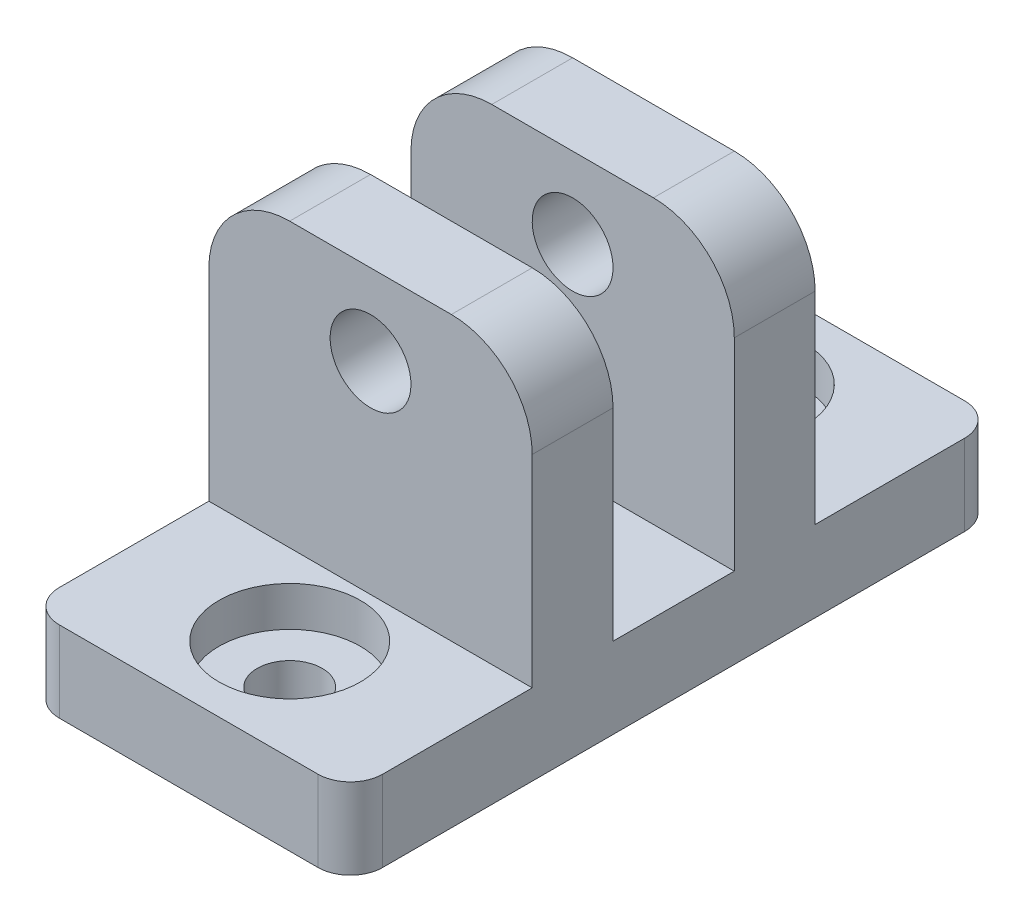
ISO-10303-21;
HEADER;
FILE_DESCRIPTION(('STEP AP214'),'2;1');
FILE_NAME('part.step','',(''),(''),'','','');
FILE_SCHEMA(('AUTOMOTIVE_DESIGN { 1 0 10303 214 1 1 1 1 }'));
ENDSEC;
DATA;
#1=APPLICATION_CONTEXT('core data for automotive mechanical design processes');
#2=APPLICATION_PROTOCOL_DEFINITION('international standard','automotive_design',2000,#1);
#3=PRODUCT_CONTEXT('',#1,'mechanical');
#4=PRODUCT('Part','Part','',(#3));
#5=PRODUCT_RELATED_PRODUCT_CATEGORY('part','',(#4));
#6=PRODUCT_DEFINITION_FORMATION('','',#4);
#7=PRODUCT_DEFINITION_CONTEXT('part definition',#1,'design');
#8=PRODUCT_DEFINITION('design','',#6,#7);
#9=PRODUCT_DEFINITION_SHAPE('','',#8);
#10=(LENGTH_UNIT() NAMED_UNIT(*) SI_UNIT(.MILLI.,.METRE.));
#11=(NAMED_UNIT(*) PLANE_ANGLE_UNIT() SI_UNIT($,.RADIAN.));
#12=(NAMED_UNIT(*) SI_UNIT($,.STERADIAN.) SOLID_ANGLE_UNIT());
#13=UNCERTAINTY_MEASURE_WITH_UNIT(LENGTH_MEASURE(1.E-05),#10,'distance_accuracy_value','');
#14=(GEOMETRIC_REPRESENTATION_CONTEXT(3) GLOBAL_UNCERTAINTY_ASSIGNED_CONTEXT((#13)) GLOBAL_UNIT_ASSIGNED_CONTEXT((#10,
#11,#12)) REPRESENTATION_CONTEXT('',''));
#15=CARTESIAN_POINT('',(0.,0.,0.));
#16=DIRECTION('',(0.,0.,1.));
#17=DIRECTION('',(1.,0.,0.));
#18=AXIS2_PLACEMENT_3D('',#15,#16,#17);
#19=CARTESIAN_POINT('',(0.,28.575,0.));
#20=DIRECTION('',(0.,-1.,0.));
#21=DIRECTION('',(0.,0.,-1.));
#22=AXIS2_PLACEMENT_3D('',#19,#20,#21);
#23=PLANE('',#22);
#24=DIRECTION('',(1.,0.,0.));
#25=VECTOR('',#24,1.);
#26=CARTESIAN_POINT('',(-12.7,28.575,11.1125));
#27=LINE('',#26,#25);
#28=CARTESIAN_POINT('',(-6.35,28.575,11.1125));
#29=VERTEX_POINT('',#28);
#30=CARTESIAN_POINT('',(6.35,28.575,11.1125));
#31=VERTEX_POINT('',#30);
#32=EDGE_CURVE('E311',#29,#31,#27,.T.);
#33=ORIENTED_EDGE('',*,*,#32,.T.);
#34=DIRECTION('',(0.,0.,-1.));
#35=VECTOR('',#34,1.);
#36=CARTESIAN_POINT('',(6.35,28.575,0.));
#37=LINE('',#36,#35);
#38=CARTESIAN_POINT('',(6.35,28.575,4.7625));
#39=VERTEX_POINT('',#38);
#40=EDGE_CURVE('E341',#31,#39,#37,.T.);
#41=ORIENTED_EDGE('',*,*,#40,.T.);
#42=DIRECTION('',(1.,0.,0.));
#43=VECTOR('',#42,1.);
#44=CARTESIAN_POINT('',(-12.7,28.575,4.7625));
#45=LINE('',#44,#43);
#46=CARTESIAN_POINT('',(-6.35,28.575,4.7625));
#47=VERTEX_POINT('',#46);
#48=EDGE_CURVE('E257',#47,#39,#45,.T.);
#49=ORIENTED_EDGE('',*,*,#48,.F.);
#50=DIRECTION('',(0.,0.,1.));
#51=VECTOR('',#50,1.);
#52=CARTESIAN_POINT('',(-6.35,28.575,0.));
#53=LINE('',#52,#51);
#54=EDGE_CURVE('E337',#47,#29,#53,.T.);
#55=ORIENTED_EDGE('',*,*,#54,.T.);
#56=EDGE_LOOP('',(#33,#41,#49,#55));
#57=FACE_BOUND('',#56,.T.);
#58=ADVANCED_FACE('F42',(#57),#23,.F.);
#59=CARTESIAN_POINT('',(12.7,28.575,25.4));
#60=DIRECTION('',(-1.,0.,0.));
#61=DIRECTION('',(0.,0.,1.));
#62=AXIS2_PLACEMENT_3D('',#59,#60,#61);
#63=PLANE('',#62);
#64=DIRECTION('',(0.,0.,-1.));
#65=VECTOR('',#64,1.);
#66=CARTESIAN_POINT('',(12.7,6.35,25.4));
#67=LINE('',#66,#65);
#68=CARTESIAN_POINT('',(12.7,6.35,22.86));
#69=VERTEX_POINT('',#68);
#70=CARTESIAN_POINT('',(12.7,6.35,11.1125));
#71=VERTEX_POINT('',#70);
#72=EDGE_CURVE('E261',#69,#71,#67,.T.);
#73=ORIENTED_EDGE('',*,*,#72,.F.);
#74=DIRECTION('',(0.,-1.,0.));
#75=VECTOR('',#74,1.);
#76=CARTESIAN_POINT('',(12.7,28.575,22.86));
#77=LINE('',#76,#75);
#78=CARTESIAN_POINT('',(12.7,0.,22.86));
#79=VERTEX_POINT('',#78);
#80=EDGE_CURVE('E391',#69,#79,#77,.T.);
#81=ORIENTED_EDGE('',*,*,#80,.T.);
#82=DIRECTION('',(0.,0.,-1.));
#83=VECTOR('',#82,1.);
#84=CARTESIAN_POINT('',(12.7,0.,25.4));
#85=LINE('',#84,#83);
#86=CARTESIAN_POINT('',(12.7,0.,-22.86));
#87=VERTEX_POINT('',#86);
#88=EDGE_CURVE('E315',#79,#87,#85,.T.);
#89=ORIENTED_EDGE('',*,*,#88,.T.);
#90=DIRECTION('',(0.,-1.,0.));
#91=VECTOR('',#90,1.);
#92=CARTESIAN_POINT('',(12.7,28.575,-22.86));
#93=LINE('',#92,#91);
#94=CARTESIAN_POINT('',(12.7,6.35,-22.86));
#95=VERTEX_POINT('',#94);
#96=EDGE_CURVE('E388',#87,#95,#93,.F.);
#97=ORIENTED_EDGE('',*,*,#96,.T.);
#98=DIRECTION('',(0.,0.,-1.));
#99=VECTOR('',#98,1.);
#100=CARTESIAN_POINT('',(12.7,6.35,-25.4));
#101=LINE('',#100,#99);
#102=CARTESIAN_POINT('',(12.7,6.35,-11.1125));
#103=VERTEX_POINT('',#102);
#104=EDGE_CURVE('E233',#103,#95,#101,.T.);
#105=ORIENTED_EDGE('',*,*,#104,.F.);
#106=DIRECTION('',(0.,-1.,0.));
#107=VECTOR('',#106,1.);
#108=CARTESIAN_POINT('',(12.7,28.575,-11.1125));
#109=LINE('',#108,#107);
#110=CARTESIAN_POINT('',(12.7,22.225,-11.1125));
#111=VERTEX_POINT('',#110);
#112=EDGE_CURVE('E240',#111,#103,#109,.T.);
#113=ORIENTED_EDGE('',*,*,#112,.F.);
#114=DIRECTION('',(0.,0.,-1.));
#115=VECTOR('',#114,1.);
#116=CARTESIAN_POINT('',(12.7,22.225,25.4));
#117=LINE('',#116,#115);
#118=CARTESIAN_POINT('',(12.7,22.225,-4.7625));
#119=VERTEX_POINT('',#118);
#120=EDGE_CURVE('E351',#111,#119,#117,.F.);
#121=ORIENTED_EDGE('',*,*,#120,.T.);
#122=DIRECTION('',(0.,1.,0.));
#123=VECTOR('',#122,1.);
#124=CARTESIAN_POINT('',(12.7,28.575,-4.7625));
#125=LINE('',#124,#123);
#126=CARTESIAN_POINT('',(12.7,6.35,-4.7625));
#127=VERTEX_POINT('',#126);
#128=EDGE_CURVE('E267',#127,#119,#125,.T.);
#129=ORIENTED_EDGE('',*,*,#128,.F.);
#130=DIRECTION('',(0.,0.,-1.));
#131=VECTOR('',#130,1.);
#132=CARTESIAN_POINT('',(12.7,6.35,4.76249999999999));
#133=LINE('',#132,#131);
#134=CARTESIAN_POINT('',(12.7,6.35,4.76249999999999));
#135=VERTEX_POINT('',#134);
#136=EDGE_CURVE('E277',#135,#127,#133,.T.);
#137=ORIENTED_EDGE('',*,*,#136,.F.);
#138=DIRECTION('',(0.,-1.,0.));
#139=VECTOR('',#138,1.);
#140=CARTESIAN_POINT('',(12.7,28.575,4.7625));
#141=LINE('',#140,#139);
#142=CARTESIAN_POINT('',(12.7,22.225,4.7625));
#143=VERTEX_POINT('',#142);
#144=EDGE_CURVE('E274',#143,#135,#141,.T.);
#145=ORIENTED_EDGE('',*,*,#144,.F.);
#146=DIRECTION('',(0.,0.,-1.));
#147=VECTOR('',#146,1.);
#148=CARTESIAN_POINT('',(12.7,22.225,25.4));
#149=LINE('',#148,#147);
#150=CARTESIAN_POINT('',(12.7,22.225,11.1125));
#151=VERTEX_POINT('',#150);
#152=EDGE_CURVE('E354',#143,#151,#149,.F.);
#153=ORIENTED_EDGE('',*,*,#152,.T.);
#154=DIRECTION('',(0.,1.,0.));
#155=VECTOR('',#154,1.);
#156=CARTESIAN_POINT('',(12.7,28.575,11.1125));
#157=LINE('',#156,#155);
#158=EDGE_CURVE('E301',#71,#151,#157,.T.);
#159=ORIENTED_EDGE('',*,*,#158,.F.);
#160=EDGE_LOOP('',(#73,#81,#89,#97,#105,#113,#121,#129,#137,#145,#153,#159));
#161=FACE_BOUND('',#160,.T.);
#162=ADVANCED_FACE('F456',(#161),#63,.F.);
#163=CARTESIAN_POINT('',(-12.7,28.575,-25.4));
#164=DIRECTION('',(0.,0.,1.));
#165=DIRECTION('',(1.,0.,0.));
#166=AXIS2_PLACEMENT_3D('',#163,#164,#165);
#167=PLANE('',#166);
#168=DIRECTION('',(1.,0.,0.));
#169=VECTOR('',#168,1.);
#170=CARTESIAN_POINT('',(-12.7,6.35,-25.4));
#171=LINE('',#170,#169);
#172=CARTESIAN_POINT('',(-10.16,6.35,-25.4));
#173=VERTEX_POINT('',#172);
#174=CARTESIAN_POINT('',(10.16,6.35,-25.4));
#175=VERTEX_POINT('',#174);
#176=EDGE_CURVE('E243',#173,#175,#171,.T.);
#177=ORIENTED_EDGE('',*,*,#176,.T.);
#178=DIRECTION('',(0.,-1.,0.));
#179=VECTOR('',#178,1.);
#180=CARTESIAN_POINT('',(10.16,28.575,-25.4));
#181=LINE('',#180,#179);
#182=CARTESIAN_POINT('',(10.16,0.,-25.4));
#183=VERTEX_POINT('',#182);
#184=EDGE_CURVE('E423',#175,#183,#181,.T.);
#185=ORIENTED_EDGE('',*,*,#184,.T.);
#186=DIRECTION('',(-1.,0.,0.));
#187=VECTOR('',#186,1.);
#188=CARTESIAN_POINT('',(-12.7,0.,-25.4));
#189=LINE('',#188,#187);
#190=CARTESIAN_POINT('',(-10.16,0.,-25.4));
#191=VERTEX_POINT('',#190);
#192=EDGE_CURVE('E326',#183,#191,#189,.T.);
#193=ORIENTED_EDGE('',*,*,#192,.T.);
#194=DIRECTION('',(0.,-1.,0.));
#195=VECTOR('',#194,1.);
#196=CARTESIAN_POINT('',(-10.16,28.575,-25.4));
#197=LINE('',#196,#195);
#198=EDGE_CURVE('E420',#191,#173,#197,.F.);
#199=ORIENTED_EDGE('',*,*,#198,.T.);
#200=EDGE_LOOP('',(#177,#185,#193,#199));
#201=FACE_BOUND('',#200,.T.);
#202=ADVANCED_FACE('F463',(#201),#167,.F.);
#203=CARTESIAN_POINT('',(-12.7,28.575,25.4));
#204=DIRECTION('',(1.,0.,0.));
#205=DIRECTION('',(0.,0.,-1.));
#206=AXIS2_PLACEMENT_3D('',#203,#204,#205);
#207=PLANE('',#206);
#208=DIRECTION('',(0.,0.,1.));
#209=VECTOR('',#208,1.);
#210=CARTESIAN_POINT('',(-12.7,0.,25.4));
#211=LINE('',#210,#209);
#212=CARTESIAN_POINT('',(-12.7,0.,-22.86));
#213=VERTEX_POINT('',#212);
#214=CARTESIAN_POINT('',(-12.7,0.,22.86));
#215=VERTEX_POINT('',#214);
#216=EDGE_CURVE('E330',#213,#215,#211,.T.);
#217=ORIENTED_EDGE('',*,*,#216,.T.);
#218=DIRECTION('',(0.,-1.,0.));
#219=VECTOR('',#218,1.);
#220=CARTESIAN_POINT('',(-12.7,28.575,22.86));
#221=LINE('',#220,#219);
#222=CARTESIAN_POINT('',(-12.7,6.35,22.86));
#223=VERTEX_POINT('',#222);
#224=EDGE_CURVE('E11',#215,#223,#221,.F.);
#225=ORIENTED_EDGE('',*,*,#224,.T.);
#226=DIRECTION('',(0.,0.,-1.));
#227=VECTOR('',#226,1.);
#228=CARTESIAN_POINT('',(-12.7,6.35,25.4));
#229=LINE('',#228,#227);
#230=CARTESIAN_POINT('',(-12.7,6.35,11.1125));
#231=VERTEX_POINT('',#230);
#232=EDGE_CURVE('E297',#223,#231,#229,.T.);
#233=ORIENTED_EDGE('',*,*,#232,.T.);
#234=DIRECTION('',(0.,1.,0.));
#235=VECTOR('',#234,1.);
#236=CARTESIAN_POINT('',(-12.7,28.575,11.1125));
#237=LINE('',#236,#235);
#238=CARTESIAN_POINT('',(-12.7,22.225,11.1125));
#239=VERTEX_POINT('',#238);
#240=EDGE_CURVE('E300',#231,#239,#237,.T.);
#241=ORIENTED_EDGE('',*,*,#240,.T.);
#242=DIRECTION('',(0.,0.,1.));
#243=VECTOR('',#242,1.);
#244=CARTESIAN_POINT('',(-12.7,22.225,25.4));
#245=LINE('',#244,#243);
#246=CARTESIAN_POINT('',(-12.7,22.225,4.7625));
#247=VERTEX_POINT('',#246);
#248=EDGE_CURVE('E383',#239,#247,#245,.F.);
#249=ORIENTED_EDGE('',*,*,#248,.T.);
#250=DIRECTION('',(0.,-1.,0.));
#251=VECTOR('',#250,1.);
#252=CARTESIAN_POINT('',(-12.7,28.575,4.7625));
#253=LINE('',#252,#251);
#254=CARTESIAN_POINT('',(-12.7,6.35,4.76249999999999));
#255=VERTEX_POINT('',#254);
#256=EDGE_CURVE('E263',#247,#255,#253,.T.);
#257=ORIENTED_EDGE('',*,*,#256,.T.);
#258=DIRECTION('',(0.,0.,-1.));
#259=VECTOR('',#258,1.);
#260=CARTESIAN_POINT('',(-12.7,6.35,4.76249999999999));
#261=LINE('',#260,#259);
#262=CARTESIAN_POINT('',(-12.7,6.35,-4.7625));
#263=VERTEX_POINT('',#262);
#264=EDGE_CURVE('E266',#255,#263,#261,.T.);
#265=ORIENTED_EDGE('',*,*,#264,.T.);
#266=DIRECTION('',(0.,1.,0.));
#267=VECTOR('',#266,1.);
#268=CARTESIAN_POINT('',(-12.7,28.575,-4.7625));
#269=LINE('',#268,#267);
#270=CARTESIAN_POINT('',(-12.7,22.225,-4.7625));
#271=VERTEX_POINT('',#270);
#272=EDGE_CURVE('E270',#263,#271,#269,.T.);
#273=ORIENTED_EDGE('',*,*,#272,.T.);
#274=DIRECTION('',(0.,0.,1.));
#275=VECTOR('',#274,1.);
#276=CARTESIAN_POINT('',(-12.7,22.225,25.4));
#277=LINE('',#276,#275);
#278=CARTESIAN_POINT('',(-12.7,22.225,-11.1125));
#279=VERTEX_POINT('',#278);
#280=EDGE_CURVE('E229',#271,#279,#277,.F.);
#281=ORIENTED_EDGE('',*,*,#280,.T.);
#282=DIRECTION('',(0.,-1.,0.));
#283=VECTOR('',#282,1.);
#284=CARTESIAN_POINT('',(-12.7,28.575,-11.1125));
#285=LINE('',#284,#283);
#286=CARTESIAN_POINT('',(-12.7,6.35,-11.1125));
#287=VERTEX_POINT('',#286);
#288=EDGE_CURVE('E220',#279,#287,#285,.T.);
#289=ORIENTED_EDGE('',*,*,#288,.T.);
#290=DIRECTION('',(0.,0.,-1.));
#291=VECTOR('',#290,1.);
#292=CARTESIAN_POINT('',(-12.7,6.35,-25.4));
#293=LINE('',#292,#291);
#294=CARTESIAN_POINT('',(-12.7,6.35,-22.86));
#295=VERTEX_POINT('',#294);
#296=EDGE_CURVE('E225',#287,#295,#293,.T.);
#297=ORIENTED_EDGE('',*,*,#296,.T.);
#298=DIRECTION('',(0.,-1.,0.));
#299=VECTOR('',#298,1.);
#300=CARTESIAN_POINT('',(-12.7,28.575,-22.86));
#301=LINE('',#300,#299);
#302=EDGE_CURVE('E51',#295,#213,#301,.T.);
#303=ORIENTED_EDGE('',*,*,#302,.T.);
#304=EDGE_LOOP('',(#217,#225,#233,#241,#249,#257,#265,#273,#281,#289,#297,#303));
#305=FACE_BOUND('',#304,.T.);
#306=ADVANCED_FACE('F223',(#305),#207,.F.);
#307=CARTESIAN_POINT('',(-12.7,28.575,25.4));
#308=DIRECTION('',(0.,0.,-1.));
#309=DIRECTION('',(-1.,0.,0.));
#310=AXIS2_PLACEMENT_3D('',#307,#308,#309);
#311=PLANE('',#310);
#312=DIRECTION('',(1.,0.,0.));
#313=VECTOR('',#312,1.);
#314=CARTESIAN_POINT('',(-12.7,0.,25.4));
#315=LINE('',#314,#313);
#316=CARTESIAN_POINT('',(-10.16,0.,25.4));
#317=VERTEX_POINT('',#316);
#318=CARTESIAN_POINT('',(10.16,0.,25.4));
#319=VERTEX_POINT('',#318);
#320=EDGE_CURVE('E333',#317,#319,#315,.T.);
#321=ORIENTED_EDGE('',*,*,#320,.T.);
#322=DIRECTION('',(0.,-1.,0.));
#323=VECTOR('',#322,1.);
#324=CARTESIAN_POINT('',(10.16,28.575,25.4));
#325=LINE('',#324,#323);
#326=CARTESIAN_POINT('',(10.16,6.35,25.4));
#327=VERTEX_POINT('',#326);
#328=EDGE_CURVE('E411',#319,#327,#325,.F.);
#329=ORIENTED_EDGE('',*,*,#328,.T.);
#330=DIRECTION('',(1.,0.,0.));
#331=VECTOR('',#330,1.);
#332=CARTESIAN_POINT('',(-12.7,6.35,25.4));
#333=LINE('',#332,#331);
#334=CARTESIAN_POINT('',(-10.16,6.35,25.4));
#335=VERTEX_POINT('',#334);
#336=EDGE_CURVE('E305',#335,#327,#333,.T.);
#337=ORIENTED_EDGE('',*,*,#336,.F.);
#338=DIRECTION('',(0.,-1.,0.));
#339=VECTOR('',#338,1.);
#340=CARTESIAN_POINT('',(-10.16,28.575,25.4));
#341=LINE('',#340,#339);
#342=EDGE_CURVE('E407',#335,#317,#341,.T.);
#343=ORIENTED_EDGE('',*,*,#342,.T.);
#344=EDGE_LOOP('',(#321,#329,#337,#343));
#345=FACE_BOUND('',#344,.T.);
#346=ADVANCED_FACE('F445',(#345),#311,.F.);
#347=DIRECTION('',(1.,0.,0.));
#348=VECTOR('',#347,1.);
#349=CARTESIAN_POINT('',(-12.7,28.575,-4.7625));
#350=LINE('',#349,#348);
#351=CARTESIAN_POINT('',(-6.35,28.575,-4.7625));
#352=VERTEX_POINT('',#351);
#353=CARTESIAN_POINT('',(6.35,28.575,-4.7625));
#354=VERTEX_POINT('',#353);
#355=EDGE_CURVE('E288',#352,#354,#350,.T.);
#356=ORIENTED_EDGE('',*,*,#355,.T.);
#357=DIRECTION('',(0.,0.,-1.));
#358=VECTOR('',#357,1.);
#359=CARTESIAN_POINT('',(6.35,28.575,0.));
#360=LINE('',#359,#358);
#361=CARTESIAN_POINT('',(6.35,28.575,-11.1125));
#362=VERTEX_POINT('',#361);
#363=EDGE_CURVE('E367',#354,#362,#360,.T.);
#364=ORIENTED_EDGE('',*,*,#363,.T.);
#365=DIRECTION('',(1.,0.,0.));
#366=VECTOR('',#365,1.);
#367=CARTESIAN_POINT('',(-12.7,28.575,-11.1125));
#368=LINE('',#367,#366);
#369=CARTESIAN_POINT('',(-6.35,28.575,-11.1125));
#370=VERTEX_POINT('',#369);
#371=EDGE_CURVE('E244',#370,#362,#368,.T.);
#372=ORIENTED_EDGE('',*,*,#371,.F.);
#373=DIRECTION('',(0.,0.,1.));
#374=VECTOR('',#373,1.);
#375=CARTESIAN_POINT('',(-6.35,28.575,0.));
#376=LINE('',#375,#374);
#377=EDGE_CURVE('E363',#370,#352,#376,.T.);
#378=ORIENTED_EDGE('',*,*,#377,.T.);
#379=EDGE_LOOP('',(#356,#364,#372,#378));
#380=FACE_BOUND('',#379,.T.);
#381=ADVANCED_FACE('F472',(#380),#23,.F.);
#382=CARTESIAN_POINT('',(0.,0.,0.));
#383=DIRECTION('',(0.,-1.,0.));
#384=DIRECTION('',(0.,0.,-1.));
#385=AXIS2_PLACEMENT_3D('',#382,#383,#384);
#386=PLANE('',#385);
#387=CARTESIAN_POINT('',(0.,0.,17.4625));
#388=DIRECTION('',(0.,1.,0.));
#389=DIRECTION('',(0.,0.,1.));
#390=AXIS2_PLACEMENT_3D('',#387,#388,#389);
#391=CIRCLE('',#390,2.5527);
#392=CARTESIAN_POINT('',(0.,0.,20.0152));
#393=VERTEX_POINT('',#392);
#394=EDGE_CURVE('E794',#393,#393,#391,.T.);
#395=ORIENTED_EDGE('',*,*,#394,.T.);
#396=EDGE_LOOP('',(#395));
#397=FACE_BOUND('',#396,.T.);
#398=CARTESIAN_POINT('',(0.,0.,-17.4625));
#399=DIRECTION('',(0.,1.,0.));
#400=DIRECTION('',(0.,0.,1.));
#401=AXIS2_PLACEMENT_3D('',#398,#399,#400);
#402=CIRCLE('',#401,2.5527);
#403=CARTESIAN_POINT('',(0.,0.,-14.9098));
#404=VERTEX_POINT('',#403);
#405=EDGE_CURVE('E278',#404,#404,#402,.T.);
#406=ORIENTED_EDGE('',*,*,#405,.T.);
#407=EDGE_LOOP('',(#406));
#408=FACE_BOUND('',#407,.T.);
#409=ORIENTED_EDGE('',*,*,#88,.F.);
#410=CARTESIAN_POINT('',(10.16,0.,22.86));
#411=DIRECTION('',(0.,-1.,0.));
#412=DIRECTION('',(0.,0.,-1.));
#413=AXIS2_PLACEMENT_3D('',#410,#411,#412);
#414=CIRCLE('',#413,2.54);
#415=EDGE_CURVE('E404',#79,#319,#414,.T.);
#416=ORIENTED_EDGE('',*,*,#415,.T.);
#417=ORIENTED_EDGE('',*,*,#320,.F.);
#418=CARTESIAN_POINT('',(-10.16,0.,22.86));
#419=DIRECTION('',(0.,-1.,0.));
#420=DIRECTION('',(0.,0.,-1.));
#421=AXIS2_PLACEMENT_3D('',#418,#419,#420);
#422=CIRCLE('',#421,2.54);
#423=EDGE_CURVE('E398',#317,#215,#422,.T.);
#424=ORIENTED_EDGE('',*,*,#423,.T.);
#425=ORIENTED_EDGE('',*,*,#216,.F.);
#426=CARTESIAN_POINT('',(-10.16,0.,-22.86));
#427=DIRECTION('',(0.,-1.,0.));
#428=DIRECTION('',(0.,0.,-1.));
#429=AXIS2_PLACEMENT_3D('',#426,#427,#428);
#430=CIRCLE('',#429,2.54);
#431=EDGE_CURVE('E395',#213,#191,#430,.T.);
#432=ORIENTED_EDGE('',*,*,#431,.T.);
#433=ORIENTED_EDGE('',*,*,#192,.F.);
#434=CARTESIAN_POINT('',(10.16,0.,-22.86));
#435=DIRECTION('',(0.,-1.,0.));
#436=DIRECTION('',(0.,0.,-1.));
#437=AXIS2_PLACEMENT_3D('',#434,#435,#436);
#438=CIRCLE('',#437,2.54);
#439=EDGE_CURVE('E401',#183,#87,#438,.T.);
#440=ORIENTED_EDGE('',*,*,#439,.T.);
#441=EDGE_LOOP('',(#409,#416,#417,#424,#425,#432,#433,#440));
#442=FACE_BOUND('',#441,.T.);
#443=ADVANCED_FACE('F436',(#397,#408,#442),#386,.T.);
#444=CARTESIAN_POINT('',(-12.7,28.575,11.1125));
#445=DIRECTION('',(0.,0.,-1.));
#446=DIRECTION('',(0.,1.,0.));
#447=AXIS2_PLACEMENT_3D('',#444,#445,#446);
#448=PLANE('',#447);
#449=CARTESIAN_POINT('',(0.,22.225,11.1125));
#450=DIRECTION('',(0.,0.,-1.));
#451=DIRECTION('',(0.,1.,0.));
#452=AXIS2_PLACEMENT_3D('',#449,#450,#451);
#453=CIRCLE('',#452,3.175);
#454=CARTESIAN_POINT('',(0.,25.4,11.1125));
#455=VERTEX_POINT('',#454);
#456=EDGE_CURVE('E771',#455,#455,#453,.T.);
#457=ORIENTED_EDGE('',*,*,#456,.T.);
#458=EDGE_LOOP('',(#457));
#459=FACE_BOUND('',#458,.T.);
#460=ORIENTED_EDGE('',*,*,#158,.T.);
#461=CARTESIAN_POINT('',(6.35,22.225,11.1125));
#462=DIRECTION('',(0.,0.,-1.));
#463=DIRECTION('',(0.,1.,0.));
#464=AXIS2_PLACEMENT_3D('',#461,#462,#463);
#465=CIRCLE('',#464,6.35);
#466=EDGE_CURVE('E360',#151,#31,#465,.F.);
#467=ORIENTED_EDGE('',*,*,#466,.T.);
#468=ORIENTED_EDGE('',*,*,#32,.F.);
#469=CARTESIAN_POINT('',(-6.35,22.225,11.1125));
#470=DIRECTION('',(0.,0.,-1.));
#471=DIRECTION('',(0.,1.,0.));
#472=AXIS2_PLACEMENT_3D('',#469,#470,#471);
#473=CIRCLE('',#472,6.35);
#474=EDGE_CURVE('E357',#29,#239,#473,.F.);
#475=ORIENTED_EDGE('',*,*,#474,.T.);
#476=ORIENTED_EDGE('',*,*,#240,.F.);
#477=DIRECTION('',(1.,0.,0.));
#478=VECTOR('',#477,1.);
#479=CARTESIAN_POINT('',(-12.7,6.35,11.1125));
#480=LINE('',#479,#478);
#481=EDGE_CURVE('E316',#231,#71,#480,.T.);
#482=ORIENTED_EDGE('',*,*,#481,.T.);
#483=EDGE_LOOP('',(#460,#467,#468,#475,#476,#482));
#484=FACE_BOUND('',#483,.T.);
#485=ADVANCED_FACE('F485',(#459,#484),#448,.F.);
#486=CARTESIAN_POINT('',(-12.7,6.35,25.4));
#487=DIRECTION('',(0.,-1.,0.));
#488=DIRECTION('',(0.,0.,-1.));
#489=AXIS2_PLACEMENT_3D('',#486,#487,#488);
#490=PLANE('',#489);
#491=CARTESIAN_POINT('',(0.,6.34999999999999,17.4625));
#492=DIRECTION('',(0.,1.,0.));
#493=DIRECTION('',(0.,0.,1.));
#494=AXIS2_PLACEMENT_3D('',#491,#492,#493);
#495=CIRCLE('',#494,5.55625);
#496=CARTESIAN_POINT('',(0.,6.34999999999999,23.01875));
#497=VERTEX_POINT('',#496);
#498=EDGE_CURVE('E774',#497,#497,#495,.T.);
#499=ORIENTED_EDGE('',*,*,#498,.F.);
#500=EDGE_LOOP('',(#499));
#501=FACE_BOUND('',#500,.T.);
#502=ORIENTED_EDGE('',*,*,#336,.T.);
#503=CARTESIAN_POINT('',(10.16,6.35,22.86));
#504=DIRECTION('',(0.,-1.,0.));
#505=DIRECTION('',(0.,0.,-1.));
#506=AXIS2_PLACEMENT_3D('',#503,#504,#505);
#507=CIRCLE('',#506,2.54);
#508=EDGE_CURVE('E417',#327,#69,#507,.F.);
#509=ORIENTED_EDGE('',*,*,#508,.T.);
#510=ORIENTED_EDGE('',*,*,#72,.T.);
#511=ORIENTED_EDGE('',*,*,#481,.F.);
#512=ORIENTED_EDGE('',*,*,#232,.F.);
#513=CARTESIAN_POINT('',(-10.16,6.35,22.86));
#514=DIRECTION('',(0.,-1.,0.));
#515=DIRECTION('',(0.,0.,-1.));
#516=AXIS2_PLACEMENT_3D('',#513,#514,#515);
#517=CIRCLE('',#516,2.54);
#518=EDGE_CURVE('E414',#223,#335,#517,.F.);
#519=ORIENTED_EDGE('',*,*,#518,.T.);
#520=EDGE_LOOP('',(#502,#509,#510,#511,#512,#519));
#521=FACE_BOUND('',#520,.T.);
#522=ADVANCED_FACE('F449',(#501,#521),#490,.F.);
#523=CARTESIAN_POINT('',(-12.7,28.575,4.7625));
#524=DIRECTION('',(0.,0.,1.));
#525=DIRECTION('',(0.,-1.,0.));
#526=AXIS2_PLACEMENT_3D('',#523,#524,#525);
#527=PLANE('',#526);
#528=CARTESIAN_POINT('',(0.,22.225,4.7625));
#529=DIRECTION('',(0.,0.,1.));
#530=DIRECTION('',(0.,-1.,0.));
#531=AXIS2_PLACEMENT_3D('',#528,#529,#530);
#532=CIRCLE('',#531,3.175);
#533=CARTESIAN_POINT('',(0.,19.05,4.7625));
#534=VERTEX_POINT('',#533);
#535=EDGE_CURVE('E775',#534,#534,#532,.T.);
#536=ORIENTED_EDGE('',*,*,#535,.T.);
#537=EDGE_LOOP('',(#536));
#538=FACE_BOUND('',#537,.T.);
#539=ORIENTED_EDGE('',*,*,#48,.T.);
#540=CARTESIAN_POINT('',(6.35,22.225,4.7625));
#541=DIRECTION('',(0.,0.,1.));
#542=DIRECTION('',(0.,-1.,0.));
#543=AXIS2_PLACEMENT_3D('',#540,#541,#542);
#544=CIRCLE('',#543,6.35);
#545=EDGE_CURVE('E348',#39,#143,#544,.F.);
#546=ORIENTED_EDGE('',*,*,#545,.T.);
#547=ORIENTED_EDGE('',*,*,#144,.T.);
#548=DIRECTION('',(1.,0.,0.));
#549=VECTOR('',#548,1.);
#550=CARTESIAN_POINT('',(-12.7,6.35,4.76249999999999));
#551=LINE('',#550,#549);
#552=EDGE_CURVE('E273',#255,#135,#551,.T.);
#553=ORIENTED_EDGE('',*,*,#552,.F.);
#554=ORIENTED_EDGE('',*,*,#256,.F.);
#555=CARTESIAN_POINT('',(-6.35,22.225,4.7625));
#556=DIRECTION('',(0.,0.,1.));
#557=DIRECTION('',(0.,-1.,0.));
#558=AXIS2_PLACEMENT_3D('',#555,#556,#557);
#559=CIRCLE('',#558,6.35);
#560=EDGE_CURVE('E345',#247,#47,#559,.F.);
#561=ORIENTED_EDGE('',*,*,#560,.T.);
#562=EDGE_LOOP('',(#539,#546,#547,#553,#554,#561));
#563=FACE_BOUND('',#562,.T.);
#564=ADVANCED_FACE('F523',(#538,#563),#527,.F.);
#565=CARTESIAN_POINT('',(-12.7,28.575,-4.7625));
#566=DIRECTION('',(0.,0.,-1.));
#567=DIRECTION('',(0.,1.,0.));
#568=AXIS2_PLACEMENT_3D('',#565,#566,#567);
#569=PLANE('',#568);
#570=CARTESIAN_POINT('',(0.,22.225,-4.7625));
#571=DIRECTION('',(0.,0.,-1.));
#572=DIRECTION('',(0.,1.,0.));
#573=AXIS2_PLACEMENT_3D('',#570,#571,#572);
#574=CIRCLE('',#573,3.175);
#575=CARTESIAN_POINT('',(0.,25.4,-4.7625));
#576=VERTEX_POINT('',#575);
#577=EDGE_CURVE('E783',#576,#576,#574,.T.);
#578=ORIENTED_EDGE('',*,*,#577,.T.);
#579=EDGE_LOOP('',(#578));
#580=FACE_BOUND('',#579,.T.);
#581=ORIENTED_EDGE('',*,*,#128,.T.);
#582=CARTESIAN_POINT('',(6.35,22.225,-4.7625));
#583=DIRECTION('',(0.,0.,-1.));
#584=DIRECTION('',(0.,1.,0.));
#585=AXIS2_PLACEMENT_3D('',#582,#583,#584);
#586=CIRCLE('',#585,6.35);
#587=EDGE_CURVE('E380',#119,#354,#586,.F.);
#588=ORIENTED_EDGE('',*,*,#587,.T.);
#589=ORIENTED_EDGE('',*,*,#355,.F.);
#590=CARTESIAN_POINT('',(-6.35,22.225,-4.7625));
#591=DIRECTION('',(0.,0.,-1.));
#592=DIRECTION('',(0.,1.,0.));
#593=AXIS2_PLACEMENT_3D('',#590,#591,#592);
#594=CIRCLE('',#593,6.35);
#595=EDGE_CURVE('E377',#352,#271,#594,.F.);
#596=ORIENTED_EDGE('',*,*,#595,.T.);
#597=ORIENTED_EDGE('',*,*,#272,.F.);
#598=DIRECTION('',(1.,0.,0.));
#599=VECTOR('',#598,1.);
#600=CARTESIAN_POINT('',(-12.7,6.35,-4.7625));
#601=LINE('',#600,#599);
#602=EDGE_CURVE('E292',#263,#127,#601,.T.);
#603=ORIENTED_EDGE('',*,*,#602,.T.);
#604=EDGE_LOOP('',(#581,#588,#589,#596,#597,#603));
#605=FACE_BOUND('',#604,.T.);
#606=ADVANCED_FACE('F499',(#580,#605),#569,.F.);
#607=CARTESIAN_POINT('',(-12.7,6.35,4.76249999999999));
#608=DIRECTION('',(0.,-1.,0.));
#609=DIRECTION('',(0.,0.,-1.));
#610=AXIS2_PLACEMENT_3D('',#607,#608,#609);
#611=PLANE('',#610);
#612=ORIENTED_EDGE('',*,*,#136,.T.);
#613=ORIENTED_EDGE('',*,*,#602,.F.);
#614=ORIENTED_EDGE('',*,*,#264,.F.);
#615=ORIENTED_EDGE('',*,*,#552,.T.);
#616=EDGE_LOOP('',(#612,#613,#614,#615));
#617=FACE_BOUND('',#616,.T.);
#618=ADVANCED_FACE('F503',(#617),#611,.F.);
#619=CARTESIAN_POINT('',(-12.7,6.35,-25.4));
#620=DIRECTION('',(0.,-1.,0.));
#621=DIRECTION('',(0.,0.,-1.));
#622=AXIS2_PLACEMENT_3D('',#619,#620,#621);
#623=PLANE('',#622);
#624=CARTESIAN_POINT('',(0.,6.35,-17.4625));
#625=DIRECTION('',(0.,1.,0.));
#626=DIRECTION('',(0.,0.,1.));
#627=AXIS2_PLACEMENT_3D('',#624,#625,#626);
#628=CIRCLE('',#627,5.55625);
#629=CARTESIAN_POINT('',(0.,6.35,-11.90625));
#630=VERTEX_POINT('',#629);
#631=EDGE_CURVE('E798',#630,#630,#628,.T.);
#632=ORIENTED_EDGE('',*,*,#631,.F.);
#633=EDGE_LOOP('',(#632));
#634=FACE_BOUND('',#633,.T.);
#635=ORIENTED_EDGE('',*,*,#104,.T.);
#636=CARTESIAN_POINT('',(10.16,6.35,-22.86));
#637=DIRECTION('',(0.,-1.,0.));
#638=DIRECTION('',(0.,0.,-1.));
#639=AXIS2_PLACEMENT_3D('',#636,#637,#638);
#640=CIRCLE('',#639,2.54);
#641=EDGE_CURVE('E70',#95,#175,#640,.F.);
#642=ORIENTED_EDGE('',*,*,#641,.T.);
#643=ORIENTED_EDGE('',*,*,#176,.F.);
#644=CARTESIAN_POINT('',(-10.16,6.35,-22.86));
#645=DIRECTION('',(0.,-1.,0.));
#646=DIRECTION('',(0.,0.,-1.));
#647=AXIS2_PLACEMENT_3D('',#644,#645,#646);
#648=CIRCLE('',#647,2.54);
#649=EDGE_CURVE('E61',#173,#295,#648,.F.);
#650=ORIENTED_EDGE('',*,*,#649,.T.);
#651=ORIENTED_EDGE('',*,*,#296,.F.);
#652=DIRECTION('',(1.,0.,0.));
#653=VECTOR('',#652,1.);
#654=CARTESIAN_POINT('',(-12.7,6.35,-11.1125));
#655=LINE('',#654,#653);
#656=EDGE_CURVE('E236',#287,#103,#655,.T.);
#657=ORIENTED_EDGE('',*,*,#656,.T.);
#658=EDGE_LOOP('',(#635,#642,#643,#650,#651,#657));
#659=FACE_BOUND('',#658,.T.);
#660=ADVANCED_FACE('F246',(#634,#659),#623,.F.);
#661=CARTESIAN_POINT('',(-12.7,28.575,-11.1125));
#662=DIRECTION('',(0.,0.,1.));
#663=DIRECTION('',(0.,-1.,0.));
#664=AXIS2_PLACEMENT_3D('',#661,#662,#663);
#665=PLANE('',#664);
#666=CARTESIAN_POINT('',(0.,22.225,-11.1125));
#667=DIRECTION('',(0.,0.,-1.));
#668=DIRECTION('',(0.,1.,0.));
#669=AXIS2_PLACEMENT_3D('',#666,#667,#668);
#670=CIRCLE('',#669,3.175);
#671=CARTESIAN_POINT('',(0.,25.4,-11.1125));
#672=VERTEX_POINT('',#671);
#673=EDGE_CURVE('E829',#672,#672,#670,.T.);
#674=ORIENTED_EDGE('',*,*,#673,.F.);
#675=EDGE_LOOP('',(#674));
#676=FACE_BOUND('',#675,.T.);
#677=ORIENTED_EDGE('',*,*,#371,.T.);
#678=CARTESIAN_POINT('',(6.35,22.225,-11.1125));
#679=DIRECTION('',(0.,0.,1.));
#680=DIRECTION('',(0.,-1.,0.));
#681=AXIS2_PLACEMENT_3D('',#678,#679,#680);
#682=CIRCLE('',#681,6.35);
#683=EDGE_CURVE('E374',#362,#111,#682,.F.);
#684=ORIENTED_EDGE('',*,*,#683,.T.);
#685=ORIENTED_EDGE('',*,*,#112,.T.);
#686=ORIENTED_EDGE('',*,*,#656,.F.);
#687=ORIENTED_EDGE('',*,*,#288,.F.);
#688=CARTESIAN_POINT('',(-6.35,22.225,-11.1125));
#689=DIRECTION('',(0.,0.,1.));
#690=DIRECTION('',(0.,-1.,0.));
#691=AXIS2_PLACEMENT_3D('',#688,#689,#690);
#692=CIRCLE('',#691,6.35);
#693=EDGE_CURVE('E371',#279,#370,#692,.F.);
#694=ORIENTED_EDGE('',*,*,#693,.T.);
#695=EDGE_LOOP('',(#677,#684,#685,#686,#687,#694));
#696=FACE_BOUND('',#695,.T.);
#697=ADVANCED_FACE('F238',(#676,#696),#665,.F.);
#698=CARTESIAN_POINT('',(0.,6.35,-17.4625));
#699=DIRECTION('',(0.,1.,0.));
#700=DIRECTION('',(0.,0.,1.));
#701=AXIS2_PLACEMENT_3D('',#698,#699,#700);
#702=CYLINDRICAL_SURFACE('',#701,2.5527);
#703=ORIENTED_EDGE('',*,*,#405,.F.);
#704=EDGE_LOOP('',(#703));
#705=FACE_BOUND('',#704,.T.);
#706=CARTESIAN_POINT('',(0.,3.2258,-17.4625));
#707=DIRECTION('',(0.,1.,0.));
#708=DIRECTION('',(0.,0.,1.));
#709=AXIS2_PLACEMENT_3D('',#706,#707,#708);
#710=CIRCLE('',#709,2.5527);
#711=CARTESIAN_POINT('',(0.,3.2258,-14.9098));
#712=VERTEX_POINT('',#711);
#713=EDGE_CURVE('E806',#712,#712,#710,.T.);
#714=ORIENTED_EDGE('',*,*,#713,.T.);
#715=EDGE_LOOP('',(#714));
#716=FACE_BOUND('',#715,.T.);
#717=ADVANCED_FACE('F645',(#705,#716),#702,.F.);
#718=CARTESIAN_POINT('',(2.55269999999999,3.2258,-17.4625));
#719=DIRECTION('',(0.,-1.,0.));
#720=DIRECTION('',(0.,0.,-1.));
#721=AXIS2_PLACEMENT_3D('',#718,#719,#720);
#722=PLANE('',#721);
#723=ORIENTED_EDGE('',*,*,#713,.F.);
#724=EDGE_LOOP('',(#723));
#725=FACE_BOUND('',#724,.T.);
#726=CARTESIAN_POINT('',(0.,3.2258,-17.4625));
#727=DIRECTION('',(0.,1.,0.));
#728=DIRECTION('',(0.,0.,1.));
#729=AXIS2_PLACEMENT_3D('',#726,#727,#728);
#730=CIRCLE('',#729,5.55625);
#731=CARTESIAN_POINT('',(0.,3.2258,-11.90625));
#732=VERTEX_POINT('',#731);
#733=EDGE_CURVE('E802',#732,#732,#730,.T.);
#734=ORIENTED_EDGE('',*,*,#733,.T.);
#735=EDGE_LOOP('',(#734));
#736=FACE_BOUND('',#735,.T.);
#737=ADVANCED_FACE('F636',(#725,#736),#722,.F.);
#738=CARTESIAN_POINT('',(0.,6.35,-17.4625));
#739=DIRECTION('',(0.,1.,0.));
#740=DIRECTION('',(0.,0.,1.));
#741=AXIS2_PLACEMENT_3D('',#738,#739,#740);
#742=CYLINDRICAL_SURFACE('',#741,5.55625);
#743=ORIENTED_EDGE('',*,*,#733,.F.);
#744=EDGE_LOOP('',(#743));
#745=FACE_BOUND('',#744,.T.);
#746=ORIENTED_EDGE('',*,*,#631,.T.);
#747=EDGE_LOOP('',(#746));
#748=FACE_BOUND('',#747,.T.);
#749=ADVANCED_FACE('F627',(#745,#748),#742,.F.);
#750=CARTESIAN_POINT('',(0.,6.34999999999999,17.4625));
#751=DIRECTION('',(0.,1.,0.));
#752=DIRECTION('',(0.,0.,1.));
#753=AXIS2_PLACEMENT_3D('',#750,#751,#752);
#754=CYLINDRICAL_SURFACE('',#753,2.5527);
#755=ORIENTED_EDGE('',*,*,#394,.F.);
#756=EDGE_LOOP('',(#755));
#757=FACE_BOUND('',#756,.T.);
#758=CARTESIAN_POINT('',(0.,3.22579999999999,17.4625));
#759=DIRECTION('',(0.,1.,0.));
#760=DIRECTION('',(0.,0.,1.));
#761=AXIS2_PLACEMENT_3D('',#758,#759,#760);
#762=CIRCLE('',#761,2.5527);
#763=CARTESIAN_POINT('',(0.,3.22579999999999,20.0152));
#764=VERTEX_POINT('',#763);
#765=EDGE_CURVE('E790',#764,#764,#762,.T.);
#766=ORIENTED_EDGE('',*,*,#765,.T.);
#767=EDGE_LOOP('',(#766));
#768=FACE_BOUND('',#767,.T.);
#769=ADVANCED_FACE('F618',(#757,#768),#754,.F.);
#770=CARTESIAN_POINT('',(2.5527,3.22579999999999,17.4625));
#771=DIRECTION('',(0.,-1.,0.));
#772=DIRECTION('',(0.,0.,-1.));
#773=AXIS2_PLACEMENT_3D('',#770,#771,#772);
#774=PLANE('',#773);
#775=ORIENTED_EDGE('',*,*,#765,.F.);
#776=EDGE_LOOP('',(#775));
#777=FACE_BOUND('',#776,.T.);
#778=CARTESIAN_POINT('',(0.,3.22579999999999,17.4625));
#779=DIRECTION('',(0.,1.,0.));
#780=DIRECTION('',(0.,0.,1.));
#781=AXIS2_PLACEMENT_3D('',#778,#779,#780);
#782=CIRCLE('',#781,5.55625);
#783=CARTESIAN_POINT('',(0.,3.22579999999999,23.01875));
#784=VERTEX_POINT('',#783);
#785=EDGE_CURVE('E779',#784,#784,#782,.T.);
#786=ORIENTED_EDGE('',*,*,#785,.T.);
#787=EDGE_LOOP('',(#786));
#788=FACE_BOUND('',#787,.T.);
#789=ADVANCED_FACE('F609',(#777,#788),#774,.F.);
#790=CARTESIAN_POINT('',(0.,6.34999999999999,17.4625));
#791=DIRECTION('',(0.,1.,0.));
#792=DIRECTION('',(0.,0.,1.));
#793=AXIS2_PLACEMENT_3D('',#790,#791,#792);
#794=CYLINDRICAL_SURFACE('',#793,5.55625);
#795=ORIENTED_EDGE('',*,*,#785,.F.);
#796=EDGE_LOOP('',(#795));
#797=FACE_BOUND('',#796,.T.);
#798=ORIENTED_EDGE('',*,*,#498,.T.);
#799=EDGE_LOOP('',(#798));
#800=FACE_BOUND('',#799,.T.);
#801=ADVANCED_FACE('F601',(#797,#800),#794,.F.);
#802=CARTESIAN_POINT('',(0.,22.225,25.4));
#803=DIRECTION('',(0.,0.,-1.));
#804=DIRECTION('',(0.,1.,0.));
#805=AXIS2_PLACEMENT_3D('',#802,#803,#804);
#806=CYLINDRICAL_SURFACE('',#805,3.175);
#807=ORIENTED_EDGE('',*,*,#673,.T.);
#808=EDGE_LOOP('',(#807));
#809=FACE_BOUND('',#808,.T.);
#810=ORIENTED_EDGE('',*,*,#577,.F.);
#811=EDGE_LOOP('',(#810));
#812=FACE_BOUND('',#811,.T.);
#813=ADVANCED_FACE('F592',(#809,#812),#806,.F.);
#814=ORIENTED_EDGE('',*,*,#535,.F.);
#815=EDGE_LOOP('',(#814));
#816=FACE_BOUND('',#815,.T.);
#817=ORIENTED_EDGE('',*,*,#456,.F.);
#818=EDGE_LOOP('',(#817));
#819=FACE_BOUND('',#818,.T.);
#820=ADVANCED_FACE('F584',(#816,#819),#806,.F.);
#821=CARTESIAN_POINT('',(6.35,22.225,0.));
#822=DIRECTION('',(0.,0.,-1.));
#823=DIRECTION('',(-1.,0.,0.));
#824=AXIS2_PLACEMENT_3D('',#821,#822,#823);
#825=CYLINDRICAL_SURFACE('',#824,6.35);
#826=ORIENTED_EDGE('',*,*,#466,.F.);
#827=ORIENTED_EDGE('',*,*,#152,.F.);
#828=ORIENTED_EDGE('',*,*,#545,.F.);
#829=ORIENTED_EDGE('',*,*,#40,.F.);
#830=EDGE_LOOP('',(#826,#827,#828,#829));
#831=FACE_BOUND('',#830,.T.);
#832=ADVANCED_FACE('F510',(#831),#825,.T.);
#833=CARTESIAN_POINT('',(6.35,22.225,0.));
#834=DIRECTION('',(0.,0.,-1.));
#835=DIRECTION('',(-1.,0.,0.));
#836=AXIS2_PLACEMENT_3D('',#833,#834,#835);
#837=CYLINDRICAL_SURFACE('',#836,6.35);
#838=ORIENTED_EDGE('',*,*,#587,.F.);
#839=ORIENTED_EDGE('',*,*,#120,.F.);
#840=ORIENTED_EDGE('',*,*,#683,.F.);
#841=ORIENTED_EDGE('',*,*,#363,.F.);
#842=EDGE_LOOP('',(#838,#839,#840,#841));
#843=FACE_BOUND('',#842,.T.);
#844=ADVANCED_FACE('F495',(#843),#837,.T.);
#845=CARTESIAN_POINT('',(-6.35,22.225,0.));
#846=DIRECTION('',(0.,0.,1.));
#847=DIRECTION('',(1.,0.,0.));
#848=AXIS2_PLACEMENT_3D('',#845,#846,#847);
#849=CYLINDRICAL_SURFACE('',#848,6.35);
#850=ORIENTED_EDGE('',*,*,#693,.F.);
#851=ORIENTED_EDGE('',*,*,#280,.F.);
#852=ORIENTED_EDGE('',*,*,#595,.F.);
#853=ORIENTED_EDGE('',*,*,#377,.F.);
#854=EDGE_LOOP('',(#850,#851,#852,#853));
#855=FACE_BOUND('',#854,.T.);
#856=ADVANCED_FACE('F525',(#855),#849,.T.);
#857=CARTESIAN_POINT('',(-6.35,22.225,0.));
#858=DIRECTION('',(0.,0.,1.));
#859=DIRECTION('',(1.,0.,0.));
#860=AXIS2_PLACEMENT_3D('',#857,#858,#859);
#861=CYLINDRICAL_SURFACE('',#860,6.35);
#862=ORIENTED_EDGE('',*,*,#560,.F.);
#863=ORIENTED_EDGE('',*,*,#248,.F.);
#864=ORIENTED_EDGE('',*,*,#474,.F.);
#865=ORIENTED_EDGE('',*,*,#54,.F.);
#866=EDGE_LOOP('',(#862,#863,#864,#865));
#867=FACE_BOUND('',#866,.T.);
#868=ADVANCED_FACE('F518',(#867),#861,.T.);
#869=CARTESIAN_POINT('',(10.16,28.575,22.86));
#870=DIRECTION('',(0.,-1.,0.));
#871=DIRECTION('',(0.,0.,-1.));
#872=AXIS2_PLACEMENT_3D('',#869,#870,#871);
#873=CYLINDRICAL_SURFACE('',#872,2.54);
#874=ORIENTED_EDGE('',*,*,#508,.F.);
#875=ORIENTED_EDGE('',*,*,#328,.F.);
#876=ORIENTED_EDGE('',*,*,#415,.F.);
#877=ORIENTED_EDGE('',*,*,#80,.F.);
#878=EDGE_LOOP('',(#874,#875,#876,#877));
#879=FACE_BOUND('',#878,.T.);
#880=ADVANCED_FACE('F454',(#879),#873,.T.);
#881=CARTESIAN_POINT('',(10.16,28.575,-22.86));
#882=DIRECTION('',(0.,-1.,0.));
#883=DIRECTION('',(0.,0.,-1.));
#884=AXIS2_PLACEMENT_3D('',#881,#882,#883);
#885=CYLINDRICAL_SURFACE('',#884,2.54);
#886=ORIENTED_EDGE('',*,*,#641,.F.);
#887=ORIENTED_EDGE('',*,*,#96,.F.);
#888=ORIENTED_EDGE('',*,*,#439,.F.);
#889=ORIENTED_EDGE('',*,*,#184,.F.);
#890=EDGE_LOOP('',(#886,#887,#888,#889));
#891=FACE_BOUND('',#890,.T.);
#892=ADVANCED_FACE('F461',(#891),#885,.T.);
#893=CARTESIAN_POINT('',(-10.16,28.575,22.86));
#894=DIRECTION('',(0.,-1.,0.));
#895=DIRECTION('',(0.,0.,-1.));
#896=AXIS2_PLACEMENT_3D('',#893,#894,#895);
#897=CYLINDRICAL_SURFACE('',#896,2.54);
#898=ORIENTED_EDGE('',*,*,#518,.F.);
#899=ORIENTED_EDGE('',*,*,#224,.F.);
#900=ORIENTED_EDGE('',*,*,#423,.F.);
#901=ORIENTED_EDGE('',*,*,#342,.F.);
#902=EDGE_LOOP('',(#898,#899,#900,#901));
#903=FACE_BOUND('',#902,.T.);
#904=ADVANCED_FACE('F442',(#903),#897,.T.);
#905=CARTESIAN_POINT('',(-10.16,28.575,-22.86));
#906=DIRECTION('',(0.,-1.,0.));
#907=DIRECTION('',(0.,0.,-1.));
#908=AXIS2_PLACEMENT_3D('',#905,#906,#907);
#909=CYLINDRICAL_SURFACE('',#908,2.54);
#910=ORIENTED_EDGE('',*,*,#649,.F.);
#911=ORIENTED_EDGE('',*,*,#198,.F.);
#912=ORIENTED_EDGE('',*,*,#431,.F.);
#913=ORIENTED_EDGE('',*,*,#302,.F.);
#914=EDGE_LOOP('',(#910,#911,#912,#913));
#915=FACE_BOUND('',#914,.T.);
#916=ADVANCED_FACE('F44',(#915),#909,.T.);
#917=CLOSED_SHELL('',(#58,#162,#202,#306,#346,#381,#443,#485,#522,#564,#606,#618,#660,#697,#717,
#737,#749,#769,#789,#801,#813,#820,#832,#844,#856,#868,#880,#892,#904,#916));
#918=MANIFOLD_SOLID_BREP('B2',#917);
#919=ADVANCED_BREP_SHAPE_REPRESENTATION('',(#18,#918),#14);
#920=SHAPE_DEFINITION_REPRESENTATION(#9,#919);
ENDSEC;
END-ISO-10303-21;
